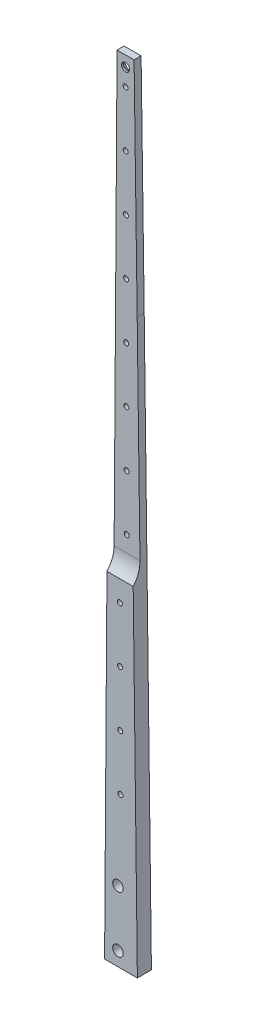
ISO-10303-21;
HEADER;
FILE_DESCRIPTION(('STEP AP214'),'2;1');
FILE_NAME('part.step','',(''),(''),'','','');
FILE_SCHEMA(('AUTOMOTIVE_DESIGN { 1 0 10303 214 1 1 1 1 }'));
ENDSEC;
DATA;
#1=APPLICATION_CONTEXT('core data for automotive mechanical design processes');
#2=APPLICATION_PROTOCOL_DEFINITION('international standard','automotive_design',2000,#1);
#3=PRODUCT_CONTEXT('',#1,'mechanical');
#4=PRODUCT('Part','Part','',(#3));
#5=PRODUCT_RELATED_PRODUCT_CATEGORY('part','',(#4));
#6=PRODUCT_DEFINITION_FORMATION('','',#4);
#7=PRODUCT_DEFINITION_CONTEXT('part definition',#1,'design');
#8=PRODUCT_DEFINITION('design','',#6,#7);
#9=PRODUCT_DEFINITION_SHAPE('','',#8);
#10=(LENGTH_UNIT() NAMED_UNIT(*) SI_UNIT(.MILLI.,.METRE.));
#11=(NAMED_UNIT(*) PLANE_ANGLE_UNIT() SI_UNIT($,.RADIAN.));
#12=(NAMED_UNIT(*) SI_UNIT($,.STERADIAN.) SOLID_ANGLE_UNIT());
#13=UNCERTAINTY_MEASURE_WITH_UNIT(LENGTH_MEASURE(1.E-05),#10,'distance_accuracy_value','');
#14=(GEOMETRIC_REPRESENTATION_CONTEXT(3) GLOBAL_UNCERTAINTY_ASSIGNED_CONTEXT((#13)) GLOBAL_UNIT_ASSIGNED_CONTEXT((#10,
#11,#12)) REPRESENTATION_CONTEXT('',''));
#15=CARTESIAN_POINT('',(0.,0.,0.));
#16=DIRECTION('',(0.,0.,1.));
#17=DIRECTION('',(1.,0.,0.));
#18=AXIS2_PLACEMENT_3D('',#15,#16,#17);
#19=CARTESIAN_POINT('',(9.32217062218469,164.894478893375,-6.35));
#20=DIRECTION('',(0.,0.,1.));
#21=DIRECTION('',(-1.,0.,0.));
#22=AXIS2_PLACEMENT_3D('',#19,#20,#21);
#23=PLANE('',#22);
#24=CARTESIAN_POINT('',(2.98775026478225,162.497082585507,-6.35));
#25=DIRECTION('',(0.,0.,1.));
#26=DIRECTION('',(1.,0.,0.));
#27=AXIS2_PLACEMENT_3D('',#24,#25,#26);
#28=CIRCLE('',#27,1.13029999999999);
#29=CARTESIAN_POINT('',(4.11805026478223,162.497082585507,-6.35));
#30=VERTEX_POINT('',#29);
#31=EDGE_CURVE('E251',#30,#30,#28,.T.);
#32=ORIENTED_EDGE('',*,*,#31,.T.);
#33=EDGE_LOOP('',(#32));
#34=FACE_BOUND('',#33,.T.);
#35=CARTESIAN_POINT('',(2.83264579083282,212.49684201095,-6.35));
#36=DIRECTION('',(0.,0.,1.));
#37=DIRECTION('',(1.,0.,0.));
#38=AXIS2_PLACEMENT_3D('',#35,#36,#37);
#39=CIRCLE('',#38,1.13029999999999);
#40=CARTESIAN_POINT('',(3.96294579083281,212.49684201095,-6.35));
#41=VERTEX_POINT('',#40);
#42=EDGE_CURVE('E274',#41,#41,#39,.T.);
#43=ORIENTED_EDGE('',*,*,#42,.T.);
#44=EDGE_LOOP('',(#43));
#45=FACE_BOUND('',#44,.T.);
#46=CARTESIAN_POINT('',(2.75509355385811,237.496721723671,-6.35));
#47=DIRECTION('',(0.,0.,1.));
#48=DIRECTION('',(1.,0.,0.));
#49=AXIS2_PLACEMENT_3D('',#46,#47,#48);
#50=CIRCLE('',#49,1.13029999999999);
#51=CARTESIAN_POINT('',(3.8853935538581,237.496721723671,-6.35));
#52=VERTEX_POINT('',#51);
#53=EDGE_CURVE('E280',#52,#52,#50,.T.);
#54=ORIENTED_EDGE('',*,*,#53,.T.);
#55=EDGE_LOOP('',(#54));
#56=FACE_BOUND('',#55,.T.);
#57=CARTESIAN_POINT('',(2.36733236898454,362.496120287279,-6.35));
#58=DIRECTION('',(0.,0.,1.));
#59=DIRECTION('',(1.,0.,0.));
#60=AXIS2_PLACEMENT_3D('',#57,#58,#59);
#61=CIRCLE('',#60,1.13029999999999);
#62=CARTESIAN_POINT('',(3.49763236898453,362.496120287279,-6.35));
#63=VERTEX_POINT('',#62);
#64=EDGE_CURVE('E236',#63,#63,#61,.T.);
#65=ORIENTED_EDGE('',*,*,#64,.T.);
#66=EDGE_LOOP('',(#65));
#67=FACE_BOUND('',#66,.T.);
#68=CARTESIAN_POINT('',(2.28978013200983,387.496,-6.35));
#69=DIRECTION('',(0.,0.,1.));
#70=DIRECTION('',(1.,0.,0.));
#71=AXIS2_PLACEMENT_3D('',#68,#69,#70);
#72=CIRCLE('',#71,1.13029999999999);
#73=CARTESIAN_POINT('',(3.42008013200982,387.496,-6.35));
#74=VERTEX_POINT('',#73);
#75=EDGE_CURVE('E232',#74,#74,#72,.T.);
#76=ORIENTED_EDGE('',*,*,#75,.T.);
#77=EDGE_LOOP('',(#76));
#78=FACE_BOUND('',#77,.T.);
#79=CARTESIAN_POINT('',(2.03199999999999,76.2,-6.35));
#80=DIRECTION('',(0.,0.,1.));
#81=DIRECTION('',(1.,0.,0.));
#82=AXIS2_PLACEMENT_3D('',#79,#80,#81);
#83=CIRCLE('',#82,2.38125);
#84=CARTESIAN_POINT('',(4.41324999999999,76.2,-6.35));
#85=VERTEX_POINT('',#84);
#86=EDGE_CURVE('E342',#85,#85,#83,.T.);
#87=ORIENTED_EDGE('',*,*,#86,.T.);
#88=EDGE_LOOP('',(#87));
#89=FACE_BOUND('',#88,.T.);
#90=CARTESIAN_POINT('',(2.03199999999999,50.8,-6.35));
#91=DIRECTION('',(0.,0.,1.));
#92=DIRECTION('',(1.,0.,0.));
#93=AXIS2_PLACEMENT_3D('',#90,#91,#92);
#94=CIRCLE('',#93,2.38125);
#95=CARTESIAN_POINT('',(4.41324999999999,50.8,-6.35));
#96=VERTEX_POINT('',#95);
#97=EDGE_CURVE('E336',#96,#96,#94,.T.);
#98=ORIENTED_EDGE('',*,*,#97,.T.);
#99=EDGE_LOOP('',(#98));
#100=FACE_BOUND('',#99,.T.);
#101=CARTESIAN_POINT('',(2.28978013200885,395.2335,-6.35));
#102=DIRECTION('',(0.,0.,1.));
#103=DIRECTION('',(1.,0.,0.));
#104=AXIS2_PLACEMENT_3D('',#101,#102,#103);
#105=CIRCLE('',#104,3.8989);
#106=CARTESIAN_POINT('',(-1.59728519476518,394.929947112695,-6.35));
#107=VERTEX_POINT('',#106);
#108=CARTESIAN_POINT('',(-1.59303981376289,395.587237867228,-6.35));
#109=VERTEX_POINT('',#108);
#110=EDGE_CURVE('E327',#107,#109,#105,.T.);
#111=ORIENTED_EDGE('',*,*,#110,.T.);
#112=CARTESIAN_POINT('',(-1.56462820167378,399.996,-6.35));
#113=CARTESIAN_POINT('',(-1.6371747875035,388.716209790455,-6.35));
#114=CARTESIAN_POINT('',(-1.71083889844835,377.436426733535,-6.35));
#115=CARTESIAN_POINT('',(-1.93103005471591,344.124623437937,-6.35));
#116=CARTESIAN_POINT('',(-2.08019527510727,322.071076557673,-6.35));
#117=CARTESIAN_POINT('',(-2.23129548472252,300.017543046815,-6.35));
#118=CARTESIAN_POINT('',(-2.23144308921492,299.996,-6.35));
#119=B_SPLINE_CURVE_WITH_KNOTS('',3,(#112,#113,#114,#115,#116,#117,#118),.UNSPECIFIED.,.F.,.F.,
(4,2,1,4),(0.,0.338393179002608,0.999353707800301,1.),.UNSPECIFIED.);
#120=CARTESIAN_POINT('',(-1.56462820167378,399.996,-6.35));
#121=VERTEX_POINT('',#120);
#122=EDGE_CURVE('E190',#121,#109,#119,.T.);
#123=ORIENTED_EDGE('',*,*,#122,.F.);
#124=DIRECTION('',(-1.,0.,0.));
#125=VECTOR('',#124,1.);
#126=CARTESIAN_POINT('',(6.14418846569149,399.996,-6.35));
#127=LINE('',#126,#125);
#128=CARTESIAN_POINT('',(6.14418846569149,399.996,-6.35));
#129=VERTEX_POINT('',#128);
#130=EDGE_CURVE('E197',#129,#121,#127,.T.);
#131=ORIENTED_EDGE('',*,*,#130,.F.);
#132=CARTESIAN_POINT('',(7.54616151705475,299.996,-6.35));
#133=CARTESIAN_POINT('',(7.09200287333961,333.329517912994,-6.35));
#134=CARTESIAN_POINT('',(6.6238073662164,366.662839032945,-6.35));
#135=CARTESIAN_POINT('',(6.14418846569149,399.996,-6.35));
#136=B_SPLINE_CURVE_WITH_KNOTS('',3,(#132,#133,#134,#135),.UNSPECIFIED.,.F.,.F.,(4,4),(0.,1.),.UNSPECIFIED.);
#137=CARTESIAN_POINT('',(7.54616151705475,299.996,-6.35));
#138=VERTEX_POINT('',#137);
#139=EDGE_CURVE('E203',#138,#129,#136,.T.);
#140=ORIENTED_EDGE('',*,*,#139,.F.);
#141=CARTESIAN_POINT('',(10.978749619499,29.7914342855853,-6.35));
#142=CARTESIAN_POINT('',(9.91085869355929,119.860572239238,-6.35));
#143=CARTESIAN_POINT('',(8.77329258674864,209.928893381234,-6.35));
#144=CARTESIAN_POINT('',(7.54616151705476,299.996,-6.35));
#145=B_SPLINE_CURVE_WITH_KNOTS('',3,(#141,#142,#143,#144),.UNSPECIFIED.,.F.,.F.,(4,4),(0.,1.),.UNSPECIFIED.);
#146=CARTESIAN_POINT('',(10.804334160404,44.45,-6.35));
#147=VERTEX_POINT('',#146);
#148=EDGE_CURVE('E131',#147,#138,#145,.T.);
#149=ORIENTED_EDGE('',*,*,#148,.F.);
#150=DIRECTION('',(-1.,0.,0.));
#151=VECTOR('',#150,1.);
#152=CARTESIAN_POINT('',(12.7,44.45,-6.35));
#153=LINE('',#152,#151);
#154=CARTESIAN_POINT('',(-4.0188922710135,44.45,-6.35));
#155=VERTEX_POINT('',#154);
#156=EDGE_CURVE('E348',#147,#155,#153,.T.);
#157=ORIENTED_EDGE('',*,*,#156,.T.);
#158=CARTESIAN_POINT('',(-2.23144308921492,299.996,-6.35));
#159=CARTESIAN_POINT('',(-2.23491000056348,299.490015836162,-6.35));
#160=CARTESIAN_POINT('',(-2.39299843190897,276.424514525694,-6.35));
#161=CARTESIAN_POINT('',(-2.55314908860154,253.359027395926,-6.35));
#162=CARTESIAN_POINT('',(-2.86833907382584,208.240034357139,-6.35));
#163=CARTESIAN_POINT('',(-3.0269190975399,185.680544745873,-6.35));
#164=CARTESIAN_POINT('',(-3.34635833842684,140.300046379748,-6.35));
#165=CARTESIAN_POINT('',(-3.65559703839005,96.4206918557666,-6.35));
#166=CARTESIAN_POINT('',(-3.9627245604797,52.541322480231,-6.35));
#167=CARTESIAN_POINT('',(-4.10919890948207,31.4829633980397,-6.35));
#168=B_SPLINE_CURVE_WITH_KNOTS('',3,(#158,#159,#160,#161,#162,#163,#164,#165,#166,#167),
.UNSPECIFIED.,.F.,.F.,(4,1,2,2,1,4),(0.,0.00565317431811734,0.257702337274979,0.509751499418767,
0.764722557038449,1.),.UNSPECIFIED.);
#169=CARTESIAN_POINT('',(-2.23144308921492,299.996,-6.35));
#170=VERTEX_POINT('',#169);
#171=EDGE_CURVE('E138',#170,#155,#168,.T.);
#172=ORIENTED_EDGE('',*,*,#171,.F.);
#173=EDGE_CURVE('E196',#107,#170,#119,.T.);
#174=ORIENTED_EDGE('',*,*,#173,.F.);
#175=EDGE_LOOP('',(#111,#123,#131,#140,#149,#157,#172,#174));
#176=FACE_BOUND('',#175,.T.);
#177=CARTESIAN_POINT('',(2.44488460595926,337.496240574557,-6.35));
#178=DIRECTION('',(0.,0.,1.));
#179=DIRECTION('',(1.,0.,0.));
#180=AXIS2_PLACEMENT_3D('',#177,#178,#179);
#181=CIRCLE('',#180,1.13029999999999);
#182=CARTESIAN_POINT('',(3.57518460595924,337.496240574557,-6.35));
#183=VERTEX_POINT('',#182);
#184=EDGE_CURVE('E237',#183,#183,#181,.T.);
#185=ORIENTED_EDGE('',*,*,#184,.T.);
#186=EDGE_LOOP('',(#185));
#187=FACE_BOUND('',#186,.T.);
#188=CARTESIAN_POINT('',(2.52243684293397,312.496360861836,-6.35));
#189=DIRECTION('',(0.,0.,1.));
#190=DIRECTION('',(1.,0.,0.));
#191=AXIS2_PLACEMENT_3D('',#188,#189,#190);
#192=CIRCLE('',#191,1.13029999999999);
#193=CARTESIAN_POINT('',(3.65273684293396,312.496360861836,-6.35));
#194=VERTEX_POINT('',#193);
#195=EDGE_CURVE('E241',#194,#194,#192,.T.);
#196=ORIENTED_EDGE('',*,*,#195,.T.);
#197=EDGE_LOOP('',(#196));
#198=FACE_BOUND('',#197,.T.);
#199=CARTESIAN_POINT('',(2.59998907990868,287.496481149114,-6.35));
#200=DIRECTION('',(0.,0.,1.));
#201=DIRECTION('',(1.,0.,0.));
#202=AXIS2_PLACEMENT_3D('',#199,#200,#201);
#203=CIRCLE('',#202,1.13029999999999);
#204=CARTESIAN_POINT('',(3.73028907990867,287.496481149114,-6.35));
#205=VERTEX_POINT('',#204);
#206=EDGE_CURVE('E245',#205,#205,#203,.T.);
#207=ORIENTED_EDGE('',*,*,#206,.T.);
#208=EDGE_LOOP('',(#207));
#209=FACE_BOUND('',#208,.T.);
#210=CARTESIAN_POINT('',(2.6775413168834,262.496601436393,-6.35));
#211=DIRECTION('',(0.,0.,1.));
#212=DIRECTION('',(1.,0.,0.));
#213=AXIS2_PLACEMENT_3D('',#210,#211,#212);
#214=CIRCLE('',#213,1.13029999999999);
#215=CARTESIAN_POINT('',(3.80784131688338,262.496601436393,-6.35));
#216=VERTEX_POINT('',#215);
#217=EDGE_CURVE('E248',#216,#216,#214,.T.);
#218=ORIENTED_EDGE('',*,*,#217,.T.);
#219=EDGE_LOOP('',(#218));
#220=FACE_BOUND('',#219,.T.);
#221=CARTESIAN_POINT('',(2.91019802780753,187.496962298229,-6.35));
#222=DIRECTION('',(0.,0.,1.));
#223=DIRECTION('',(1.,0.,0.));
#224=AXIS2_PLACEMENT_3D('',#221,#222,#223);
#225=CIRCLE('',#224,1.13029999999999);
#226=CARTESIAN_POINT('',(4.04049802780752,187.496962298229,-6.35));
#227=VERTEX_POINT('',#226);
#228=EDGE_CURVE('E268',#227,#227,#225,.T.);
#229=ORIENTED_EDGE('',*,*,#228,.T.);
#230=EDGE_LOOP('',(#229));
#231=FACE_BOUND('',#230,.T.);
#232=CARTESIAN_POINT('',(3.06530250175696,137.497202872786,-6.35));
#233=DIRECTION('',(0.,0.,1.));
#234=DIRECTION('',(1.,0.,0.));
#235=AXIS2_PLACEMENT_3D('',#232,#233,#234);
#236=CIRCLE('',#235,1.13029999999999);
#237=CARTESIAN_POINT('',(4.19560250175695,137.497202872786,-6.35));
#238=VERTEX_POINT('',#237);
#239=EDGE_CURVE('E252',#238,#238,#236,.T.);
#240=ORIENTED_EDGE('',*,*,#239,.T.);
#241=EDGE_LOOP('',(#240));
#242=FACE_BOUND('',#241,.T.);
#243=CARTESIAN_POINT('',(3.14285473873167,112.497323160064,-6.35));
#244=DIRECTION('',(0.,0.,1.));
#245=DIRECTION('',(1.,0.,0.));
#246=AXIS2_PLACEMENT_3D('',#243,#244,#245);
#247=CIRCLE('',#246,1.13029999999999);
#248=CARTESIAN_POINT('',(4.27315473873166,112.497323160064,-6.35));
#249=VERTEX_POINT('',#248);
#250=EDGE_CURVE('E263',#249,#249,#247,.T.);
#251=ORIENTED_EDGE('',*,*,#250,.T.);
#252=EDGE_LOOP('',(#251));
#253=FACE_BOUND('',#252,.T.);
#254=ADVANCED_FACE('F39',(#34,#45,#56,#67,#78,#89,#100,#176,#187,#198,#209,#220,#231,#242,#253),
#23,.F.);
#255=DIRECTION('',(0.,0.,1.));
#256=VECTOR('',#255,1.);
#257=SURFACE_OF_LINEAR_EXTRUSION('',#136,#256);
#258=CARTESIAN_POINT('',(7.54616151705475,299.996,-3.175));
#259=CARTESIAN_POINT('',(7.09200287333961,333.329517912994,-3.175));
#260=CARTESIAN_POINT('',(6.6238073662164,366.662839032945,-3.175));
#261=CARTESIAN_POINT('',(6.14418846569149,399.996,-3.175));
#262=B_SPLINE_CURVE_WITH_KNOTS('',3,(#258,#259,#260,#261),.UNSPECIFIED.,.F.,.F.,(4,4),(0.,1.),.UNSPECIFIED.);
#263=CARTESIAN_POINT('',(6.14418846569149,399.996,-3.175));
#264=VERTEX_POINT('',#263);
#265=CARTESIAN_POINT('',(7.54616151705475,299.996,-3.175));
#266=VERTEX_POINT('',#265);
#267=EDGE_CURVE('E313',#264,#266,#262,.F.);
#268=ORIENTED_EDGE('',*,*,#267,.T.);
#269=DIRECTION('',(0.,0.,1.));
#270=VECTOR('',#269,1.);
#271=CARTESIAN_POINT('',(7.54616151705475,299.996,-6.35));
#272=LINE('',#271,#270);
#273=EDGE_CURVE('E161',#138,#266,#272,.T.);
#274=ORIENTED_EDGE('',*,*,#273,.F.);
#275=ORIENTED_EDGE('',*,*,#139,.T.);
#276=DIRECTION('',(0.,0.,1.));
#277=VECTOR('',#276,1.);
#278=CARTESIAN_POINT('',(6.14418846569149,399.996,-6.35));
#279=LINE('',#278,#277);
#280=EDGE_CURVE('E158',#129,#264,#279,.T.);
#281=ORIENTED_EDGE('',*,*,#280,.T.);
#282=EDGE_LOOP('',(#268,#274,#275,#281));
#283=FACE_BOUND('',#282,.T.);
#284=ADVANCED_FACE('F215',(#283),#257,.T.);
#285=CARTESIAN_POINT('',(6.14418846569149,399.996,-6.35));
#286=DIRECTION('',(0.,-1.,0.));
#287=DIRECTION('',(1.,0.,0.));
#288=AXIS2_PLACEMENT_3D('',#285,#286,#287);
#289=PLANE('',#288);
#290=DIRECTION('',(1.,0.,0.));
#291=VECTOR('',#290,1.);
#292=CARTESIAN_POINT('',(-13.374739093365,399.996,-3.175));
#293=LINE('',#292,#291);
#294=CARTESIAN_POINT('',(-1.56462820167378,399.996,-3.175));
#295=VERTEX_POINT('',#294);
#296=EDGE_CURVE('E115',#295,#264,#293,.T.);
#297=ORIENTED_EDGE('',*,*,#296,.T.);
#298=ORIENTED_EDGE('',*,*,#280,.F.);
#299=ORIENTED_EDGE('',*,*,#130,.T.);
#300=DIRECTION('',(0.,0.,1.));
#301=VECTOR('',#300,1.);
#302=CARTESIAN_POINT('',(-1.56462820167378,399.996,-6.35));
#303=LINE('',#302,#301);
#304=EDGE_CURVE('E155',#121,#295,#303,.T.);
#305=ORIENTED_EDGE('',*,*,#304,.T.);
#306=EDGE_LOOP('',(#297,#298,#299,#305));
#307=FACE_BOUND('',#306,.T.);
#308=ADVANCED_FACE('F184',(#307),#289,.F.);
#309=DIRECTION('',(0.,0.,1.));
#310=VECTOR('',#309,1.);
#311=SURFACE_OF_LINEAR_EXTRUSION('',#119,#310);
#312=CARTESIAN_POINT('',(-1.56462820167378,399.996,-3.175));
#313=CARTESIAN_POINT('',(-1.6371747875035,388.716209790455,-3.175));
#314=CARTESIAN_POINT('',(-1.71083889844835,377.436426733535,-3.175));
#315=CARTESIAN_POINT('',(-1.93103005471591,344.124623437937,-3.175));
#316=CARTESIAN_POINT('',(-2.08019527510727,322.071076557673,-3.175));
#317=CARTESIAN_POINT('',(-2.23129548472252,300.017543046815,-3.175));
#318=CARTESIAN_POINT('',(-2.23144308921492,299.996,-3.175));
#319=B_SPLINE_CURVE_WITH_KNOTS('',3,(#312,#313,#314,#315,#316,#317,#318),.UNSPECIFIED.,.F.,.F.,
(4,2,1,4),(0.,0.338393179002608,0.999353707800301,1.),.UNSPECIFIED.);
#320=CARTESIAN_POINT('',(-2.23144308921492,299.996,-3.175));
#321=VERTEX_POINT('',#320);
#322=EDGE_CURVE('E302',#321,#295,#319,.F.);
#323=ORIENTED_EDGE('',*,*,#322,.T.);
#324=ORIENTED_EDGE('',*,*,#304,.F.);
#325=ORIENTED_EDGE('',*,*,#122,.T.);
#326=CARTESIAN_POINT('',(-1.59728519476517,394.929947112695,-6.35));
#327=CARTESIAN_POINT('',(-1.59657742632141,395.03949557046,-6.3393578368422));
#328=CARTESIAN_POINT('',(-1.59586976034934,395.149044028887,-6.33403675526322));
#329=CARTESIAN_POINT('',(-1.59445463334857,395.368140947065,-6.33403675526292));
#330=CARTESIAN_POINT('',(-1.59374717231988,395.477689406816,-6.3393578368416));
#331=CARTESIAN_POINT('',(-1.59303981376289,395.587237867228,-6.3499999999991));
#332=B_SPLINE_CURVE_WITH_KNOTS('',3,(#326,#327,#328,#329,#330,#331),.UNSPECIFIED.,.F.,.F.,(4,2,
4),(0.,0.329039686050416,0.658079372100812),.UNSPECIFIED.);
#333=EDGE_CURVE('E164',#107,#109,#332,.T.);
#334=ORIENTED_EDGE('',*,*,#333,.F.);
#335=ORIENTED_EDGE('',*,*,#173,.T.);
#336=DIRECTION('',(0.,0.,1.));
#337=VECTOR('',#336,1.);
#338=CARTESIAN_POINT('',(-2.23144308921492,299.996,-6.35));
#339=LINE('',#338,#337);
#340=EDGE_CURVE('E149',#170,#321,#339,.T.);
#341=ORIENTED_EDGE('',*,*,#340,.T.);
#342=EDGE_LOOP('',(#323,#324,#325,#334,#335,#341));
#343=FACE_BOUND('',#342,.T.);
#344=ADVANCED_FACE('F178',(#343),#311,.T.);
#345=CARTESIAN_POINT('',(2.28978013200885,395.2335,-6.35));
#346=DIRECTION('',(0.,0.,-1.));
#347=DIRECTION('',(1.,0.,0.));
#348=AXIS2_PLACEMENT_3D('',#345,#346,#347);
#349=CYLINDRICAL_SURFACE('',#348,1.82879999999999);
#350=CARTESIAN_POINT('',(2.28978013200885,395.2335,-3.96862236021177));
#351=DIRECTION('',(0.,0.,1.));
#352=DIRECTION('',(1.,0.,0.));
#353=AXIS2_PLACEMENT_3D('',#350,#351,#352);
#354=CIRCLE('',#353,1.82879999999999);
#355=CARTESIAN_POINT('',(4.11858013200884,395.2335,-3.96862236021177));
#356=VERTEX_POINT('',#355);
#357=EDGE_CURVE('E333',#356,#356,#354,.T.);
#358=ORIENTED_EDGE('',*,*,#357,.F.);
#359=EDGE_LOOP('',(#358));
#360=FACE_BOUND('',#359,.T.);
#361=CARTESIAN_POINT('',(2.28978013200885,395.2335,-3.175));
#362=DIRECTION('',(0.,0.,-1.));
#363=DIRECTION('',(-1.,0.,0.));
#364=AXIS2_PLACEMENT_3D('',#361,#362,#363);
#365=CIRCLE('',#364,1.82879999999999);
#366=CARTESIAN_POINT('',(0.460980132008861,395.2335,-3.175));
#367=VERTEX_POINT('',#366);
#368=EDGE_CURVE('E172',#367,#367,#365,.F.);
#369=ORIENTED_EDGE('',*,*,#368,.T.);
#370=EDGE_LOOP('',(#369));
#371=FACE_BOUND('',#370,.T.);
#372=ADVANCED_FACE('F183',(#360,#371),#349,.F.);
#373=DIRECTION('',(0.,0.,1.));
#374=VECTOR('',#373,1.);
#375=SURFACE_OF_LINEAR_EXTRUSION('',#145,#374);
#376=CARTESIAN_POINT('',(10.978749619499,29.7914342855853,0.));
#377=CARTESIAN_POINT('',(9.91085869355929,119.860572239238,0.));
#378=CARTESIAN_POINT('',(8.77329258674864,209.928893381234,0.));
#379=CARTESIAN_POINT('',(7.54616151705476,299.996,0.));
#380=B_SPLINE_CURVE_WITH_KNOTS('',3,(#376,#377,#378,#379),.UNSPECIFIED.,.F.,.F.,(4,4),(0.,1.),.UNSPECIFIED.);
#381=CARTESIAN_POINT('',(10.804334160404,44.45,0.));
#382=VERTEX_POINT('',#381);
#383=CARTESIAN_POINT('',(8.91412882013365,196.796,0.));
#384=VERTEX_POINT('',#383);
#385=EDGE_CURVE('E121',#382,#384,#380,.T.);
#386=ORIENTED_EDGE('',*,*,#385,.F.);
#387=DIRECTION('',(0.,0.,1.));
#388=VECTOR('',#387,1.);
#389=CARTESIAN_POINT('',(10.804334160404,44.45,-6.35));
#390=LINE('',#389,#388);
#391=EDGE_CURVE('E129',#382,#147,#390,.F.);
#392=ORIENTED_EDGE('',*,*,#391,.T.);
#393=ORIENTED_EDGE('',*,*,#148,.T.);
#394=ORIENTED_EDGE('',*,*,#273,.T.);
#395=CARTESIAN_POINT('',(10.978749619499,29.7914342855853,-3.175));
#396=CARTESIAN_POINT('',(9.91085869355929,119.860572239238,-3.175));
#397=CARTESIAN_POINT('',(8.77329258674864,209.928893381234,-3.175));
#398=CARTESIAN_POINT('',(7.54616151705476,299.996,-3.175));
#399=B_SPLINE_CURVE_WITH_KNOTS('',3,(#395,#396,#397,#398),.UNSPECIFIED.,.F.,.F.,(4,4),(0.,1.),.UNSPECIFIED.);
#400=CARTESIAN_POINT('',(8.80555145099561,205.19626041263,-3.175));
#401=VERTEX_POINT('',#400);
#402=EDGE_CURVE('E123',#266,#401,#399,.F.);
#403=ORIENTED_EDGE('',*,*,#402,.T.);
#404=CARTESIAN_POINT('',(8.91412882013365,196.796,0.));
#405=CARTESIAN_POINT('',(8.911828108261,196.974389819341,-0.157335072633163));
#406=CARTESIAN_POINT('',(8.90946995587916,197.157208325913,-0.309646369273341));
#407=CARTESIAN_POINT('',(8.90464639388709,197.531104583722,-0.603766508876963));
#408=CARTESIAN_POINT('',(8.90218098467464,197.722182304328,-0.745575390785927));
#409=CARTESIAN_POINT('',(8.89715049973853,198.112001424151,-1.01823783449251));
#410=CARTESIAN_POINT('',(8.89458542338508,198.310742871793,-1.14909132704896));
#411=CARTESIAN_POINT('',(8.88935941226531,198.715587456393,-1.39963437007923));
#412=CARTESIAN_POINT('',(8.88669832837307,198.921702041222,-1.51930541647878));
#413=CARTESIAN_POINT('',(8.8812926148244,199.340332392736,-1.74686136706235));
#414=CARTESIAN_POINT('',(8.87854798783908,199.552847954761,-1.85474664756565));
#415=CARTESIAN_POINT('',(8.87298408626675,199.983585208736,-2.05838381582487));
#416=CARTESIAN_POINT('',(8.87016481544353,200.201806612972,-2.15413631395131));
#417=CARTESIAN_POINT('',(8.86303123314621,200.753873861041,-2.37806534004997));
#418=CARTESIAN_POINT('',(8.85867511881369,201.09090686319,-2.49847274724908));
#419=CARTESIAN_POINT('',(8.84984454391639,201.773943309004,-2.71042612609173));
#420=CARTESIAN_POINT('',(8.84537006921629,202.119947824002,-2.80196863349355));
#421=CARTESIAN_POINT('',(8.83634660548468,202.817525384162,-2.95533787687691));
#422=CARTESIAN_POINT('',(8.83179784078929,203.169081585676,-3.01724136010271));
#423=CARTESIAN_POINT('',(8.82264852492716,203.875998324093,-3.11121449868237));
#424=CARTESIAN_POINT('',(8.81804800815526,204.231356327394,-3.14330290613172));
#425=CARTESIAN_POINT('',(8.8121246194314,204.688768537435,-3.16526342147526));
#426=CARTESIAN_POINT('',(8.81081000498075,204.790276763341,-3.16891592709835));
#427=CARTESIAN_POINT('',(8.80818082216675,204.993273452835,-3.17378292151737));
#428=CARTESIAN_POINT('',(8.80686625454704,205.094761871478,-3.1749992850327));
#429=CARTESIAN_POINT('',(8.80555145099561,205.19626041263,-3.175));
#430=B_SPLINE_CURVE_WITH_KNOTS('',3,(#404,#405,#406,#407,#408,#409,#410,#411,#412,#413,#414,
#415,#416,#417,#418,#419,#420,#421,#422,#423,#424,#425,#426,#427,#428,#429),.UNSPECIFIED.,.F.,
.F.,(4,2,2,2,2,2,2,2,2,2,2,2,4),(0.,0.713517269334272,1.42703189263964,2.14055102521979,
2.85523068123177,3.56988751086187,4.2845083735726,5.35692452345507,6.42946933118895,
7.49922166845128,8.56830073210423,8.87302895639274,9.17752258855459),.UNSPECIFIED.);
#431=EDGE_CURVE('E11',#384,#401,#430,.T.);
#432=ORIENTED_EDGE('',*,*,#431,.F.);
#433=EDGE_LOOP('',(#386,#392,#393,#394,#403,#432));
#434=FACE_BOUND('',#433,.T.);
#435=ADVANCED_FACE('F120',(#434),#375,.T.);
#436=DIRECTION('',(0.,0.,1.));
#437=VECTOR('',#436,1.);
#438=SURFACE_OF_LINEAR_EXTRUSION('',#168,#437);
#439=CARTESIAN_POINT('',(-2.23144308921492,299.996,-3.175));
#440=CARTESIAN_POINT('',(-2.23491000056348,299.490015836162,-3.175));
#441=CARTESIAN_POINT('',(-2.39299843190897,276.424514525694,-3.175));
#442=CARTESIAN_POINT('',(-2.55314908860154,253.359027395926,-3.175));
#443=CARTESIAN_POINT('',(-2.86833907382584,208.240034357139,-3.175));
#444=CARTESIAN_POINT('',(-3.0269190975399,185.680544745873,-3.175));
#445=CARTESIAN_POINT('',(-3.34635833842684,140.300046379748,-3.175));
#446=CARTESIAN_POINT('',(-3.65559703839005,96.4206918557666,-3.175));
#447=CARTESIAN_POINT('',(-3.9627245604797,52.541322480231,-3.175));
#448=CARTESIAN_POINT('',(-4.10919890948207,31.4829633980397,-3.175));
#449=B_SPLINE_CURVE_WITH_KNOTS('',3,(#439,#440,#441,#442,#443,#444,#445,#446,#447,#448),
.UNSPECIFIED.,.F.,.F.,(4,1,2,2,1,4),(0.,0.00565317431811734,0.257702337274979,0.509751499418767,
0.764722557038449,1.),.UNSPECIFIED.);
#450=CARTESIAN_POINT('',(-2.88998359130755,205.19626041263,-3.175));
#451=VERTEX_POINT('',#450);
#452=EDGE_CURVE('E306',#451,#321,#449,.F.);
#453=ORIENTED_EDGE('',*,*,#452,.T.);
#454=ORIENTED_EDGE('',*,*,#340,.F.);
#455=ORIENTED_EDGE('',*,*,#171,.T.);
#456=DIRECTION('',(0.,0.,1.));
#457=VECTOR('',#456,1.);
#458=CARTESIAN_POINT('',(-4.0188922710135,44.4500000000001,-6.35));
#459=LINE('',#458,#457);
#460=CARTESIAN_POINT('',(-4.0188922710135,44.4500000000001,0.));
#461=VERTEX_POINT('',#460);
#462=EDGE_CURVE('E133',#155,#461,#459,.T.);
#463=ORIENTED_EDGE('',*,*,#462,.T.);
#464=CARTESIAN_POINT('',(-2.23144308921492,299.996,0.));
#465=CARTESIAN_POINT('',(-2.23491000056348,299.490015836162,0.));
#466=CARTESIAN_POINT('',(-2.39299843190897,276.424514525694,0.));
#467=CARTESIAN_POINT('',(-2.55314908860154,253.359027395926,0.));
#468=CARTESIAN_POINT('',(-2.86833907382584,208.240034357139,0.));
#469=CARTESIAN_POINT('',(-3.0269190975399,185.680544745873,0.));
#470=CARTESIAN_POINT('',(-3.34635833842684,140.300046379748,0.));
#471=CARTESIAN_POINT('',(-3.65559703839005,96.4206918557666,0.));
#472=CARTESIAN_POINT('',(-3.9627245604797,52.541322480231,0.));
#473=CARTESIAN_POINT('',(-4.10919890948207,31.4829633980397,0.));
#474=B_SPLINE_CURVE_WITH_KNOTS('',3,(#464,#465,#466,#467,#468,#469,#470,#471,#472,#473),
.UNSPECIFIED.,.F.,.F.,(4,1,2,2,1,4),(0.,0.00565317431811734,0.257702337274979,0.509751499418767,
0.764722557038449,1.),.UNSPECIFIED.);
#475=CARTESIAN_POINT('',(-2.94893309170267,196.796,0.));
#476=VERTEX_POINT('',#475);
#477=EDGE_CURVE('E128',#476,#461,#474,.T.);
#478=ORIENTED_EDGE('',*,*,#477,.F.);
#479=CARTESIAN_POINT('',(-2.88998359130755,205.19626041263,-3.175));
#480=CARTESIAN_POINT('',(-2.89165183874844,204.958412578871,-3.17500752847791));
#481=CARTESIAN_POINT('',(-2.89332015830395,204.720565578128,-3.16831859484388));
#482=CARTESIAN_POINT('',(-2.89665168191138,204.245622534799,-3.14160204766512));
#483=CARTESIAN_POINT('',(-2.89831488598,204.008526489763,-3.12157447769535));
#484=CARTESIAN_POINT('',(-2.90163094053523,203.53583156292,-3.06823472961054));
#485=CARTESIAN_POINT('',(-2.90328379095505,203.300232690772,-3.03492246587616));
#486=CARTESIAN_POINT('',(-2.90657658002036,202.830896009602,-2.9550563141124));
#487=CARTESIAN_POINT('',(-2.90821649324717,202.59716185735,-2.90848094435861));
#488=CARTESIAN_POINT('',(-2.91147545608705,202.132687140085,-2.80225708524711));
#489=CARTESIAN_POINT('',(-2.91309450636706,201.901946479374,-2.7426090148972));
#490=CARTESIAN_POINT('',(-2.91630646610926,201.444209730419,-2.61043886245811));
#491=CARTESIAN_POINT('',(-2.91789937688371,201.217213454194,-2.53791742881419));
#492=CARTESIAN_POINT('',(-2.92184438942098,200.655055825937,-2.34071612801329));
#493=CARTESIAN_POINT('',(-2.92417728985362,200.322642124007,-2.20810131874011));
#494=CARTESIAN_POINT('',(-2.92875661094883,199.670174468599,-1.91529187002999));
#495=CARTESIAN_POINT('',(-2.93100302120644,199.35012200219,-1.75509392488738));
#496=CARTESIAN_POINT('',(-2.93538744575451,198.725494021564,-1.4087273788733));
#497=CARTESIAN_POINT('',(-2.93752572711715,198.420880369643,-1.22262750338411));
#498=CARTESIAN_POINT('',(-2.94168401590971,197.8285314774,-0.825535178370847));
#499=CARTESIAN_POINT('',(-2.94370409693932,197.540785733745,-0.614558471071702));
#500=CARTESIAN_POINT('',(-2.94621477888913,197.183173808138,-0.328465522106508));
#501=CARTESIAN_POINT('',(-2.9467664063294,197.104603175068,-0.264045584764277));
#502=CARTESIAN_POINT('',(-2.9478582435841,196.949090190476,-0.133389137092061));
#503=CARTESIAN_POINT('',(-2.94839846186122,196.872146632023,-0.0671540633876382));
#504=CARTESIAN_POINT('',(-2.94893309170267,196.796,0.));
#505=B_SPLINE_CURVE_WITH_KNOTS('',3,(#479,#480,#481,#482,#483,#484,#485,#486,#487,#488,#489,
#490,#491,#492,#493,#494,#495,#496,#497,#498,#499,#500,#501,#502,#503,#504),.UNSPECIFIED.,.F.,
.F.,(4,2,2,2,2,2,2,2,2,2,2,2,4),(0.,0.713465778958233,1.42692922716151,2.14039727368372,
2.85502753342702,3.56963489110384,4.28420626344326,5.35655048263683,6.42902330667366,
7.49870295048052,8.56770929039243,8.87250523323418,9.17706653573727),.UNSPECIFIED.);
#506=EDGE_CURVE('E49',#451,#476,#505,.T.);
#507=ORIENTED_EDGE('',*,*,#506,.F.);
#508=EDGE_LOOP('',(#453,#454,#455,#463,#478,#507));
#509=FACE_BOUND('',#508,.T.);
#510=ADVANCED_FACE('F186',(#509),#438,.T.);
#511=CARTESIAN_POINT('',(9.32217062218469,164.894478893375,0.));
#512=DIRECTION('',(0.,0.,1.));
#513=DIRECTION('',(-1.,0.,0.));
#514=AXIS2_PLACEMENT_3D('',#511,#512,#513);
#515=PLANE('',#514);
#516=CARTESIAN_POINT('',(3.14285473873167,112.497323160064,0.));
#517=DIRECTION('',(0.,0.,-1.));
#518=DIRECTION('',(-1.,0.,0.));
#519=AXIS2_PLACEMENT_3D('',#516,#517,#518);
#520=CIRCLE('',#519,1.13029999999999);
#521=CARTESIAN_POINT('',(2.01255473873168,112.497323160064,0.));
#522=VERTEX_POINT('',#521);
#523=EDGE_CURVE('E44',#522,#522,#520,.T.);
#524=ORIENTED_EDGE('',*,*,#523,.T.);
#525=EDGE_LOOP('',(#524));
#526=FACE_BOUND('',#525,.T.);
#527=CARTESIAN_POINT('',(3.06530250175696,137.497202872786,0.));
#528=DIRECTION('',(0.,0.,-1.));
#529=DIRECTION('',(-1.,0.,0.));
#530=AXIS2_PLACEMENT_3D('',#527,#528,#529);
#531=CIRCLE('',#530,1.13029999999999);
#532=CARTESIAN_POINT('',(1.93500250175697,137.497202872786,0.));
#533=VERTEX_POINT('',#532);
#534=EDGE_CURVE('E249',#533,#533,#531,.T.);
#535=ORIENTED_EDGE('',*,*,#534,.T.);
#536=EDGE_LOOP('',(#535));
#537=FACE_BOUND('',#536,.T.);
#538=CARTESIAN_POINT('',(2.98775026478225,162.497082585507,0.));
#539=DIRECTION('',(0.,0.,-1.));
#540=DIRECTION('',(-1.,0.,0.));
#541=AXIS2_PLACEMENT_3D('',#538,#539,#540);
#542=CIRCLE('',#541,1.13029999999999);
#543=CARTESIAN_POINT('',(1.85745026478225,162.497082585507,0.));
#544=VERTEX_POINT('',#543);
#545=EDGE_CURVE('E256',#544,#544,#542,.T.);
#546=ORIENTED_EDGE('',*,*,#545,.T.);
#547=EDGE_LOOP('',(#546));
#548=FACE_BOUND('',#547,.T.);
#549=CARTESIAN_POINT('',(2.91019802780753,187.496962298229,0.));
#550=DIRECTION('',(0.,0.,-1.));
#551=DIRECTION('',(-1.,0.,0.));
#552=AXIS2_PLACEMENT_3D('',#549,#550,#551);
#553=CIRCLE('',#552,1.13029999999999);
#554=CARTESIAN_POINT('',(1.77989802780754,187.496962298229,0.));
#555=VERTEX_POINT('',#554);
#556=EDGE_CURVE('E271',#555,#555,#553,.T.);
#557=ORIENTED_EDGE('',*,*,#556,.T.);
#558=EDGE_LOOP('',(#557));
#559=FACE_BOUND('',#558,.T.);
#560=DIRECTION('',(-1.,0.,0.));
#561=VECTOR('',#560,1.);
#562=CARTESIAN_POINT('',(-13.374739093365,196.796,0.));
#563=LINE('',#562,#561);
#564=EDGE_CURVE('E108',#384,#476,#563,.T.);
#565=ORIENTED_EDGE('',*,*,#564,.T.);
#566=ORIENTED_EDGE('',*,*,#477,.T.);
#567=DIRECTION('',(-1.,0.,0.));
#568=VECTOR('',#567,1.);
#569=CARTESIAN_POINT('',(9.32217062218472,44.45,0.));
#570=LINE('',#569,#568);
#571=EDGE_CURVE('E126',#382,#461,#570,.T.);
#572=ORIENTED_EDGE('',*,*,#571,.F.);
#573=ORIENTED_EDGE('',*,*,#385,.T.);
#574=EDGE_LOOP('',(#565,#566,#572,#573));
#575=FACE_BOUND('',#574,.T.);
#576=CARTESIAN_POINT('',(2.03199999999999,50.8,0.));
#577=DIRECTION('',(0.,0.,-1.));
#578=DIRECTION('',(-1.,0.,0.));
#579=AXIS2_PLACEMENT_3D('',#576,#577,#578);
#580=CIRCLE('',#579,2.38125);
#581=CARTESIAN_POINT('',(-0.349250000000003,50.8,0.));
#582=VERTEX_POINT('',#581);
#583=EDGE_CURVE('E339',#582,#582,#580,.T.);
#584=ORIENTED_EDGE('',*,*,#583,.T.);
#585=EDGE_LOOP('',(#584));
#586=FACE_BOUND('',#585,.T.);
#587=CARTESIAN_POINT('',(2.03199999999999,76.2,0.));
#588=DIRECTION('',(0.,0.,-1.));
#589=DIRECTION('',(-1.,0.,0.));
#590=AXIS2_PLACEMENT_3D('',#587,#588,#589);
#591=CIRCLE('',#590,2.38125);
#592=CARTESIAN_POINT('',(-0.349250000000007,76.2,0.));
#593=VERTEX_POINT('',#592);
#594=EDGE_CURVE('E345',#593,#593,#591,.T.);
#595=ORIENTED_EDGE('',*,*,#594,.T.);
#596=EDGE_LOOP('',(#595));
#597=FACE_BOUND('',#596,.T.);
#598=ADVANCED_FACE('F124',(#526,#537,#548,#559,#575,#586,#597),#515,.T.);
#599=CARTESIAN_POINT('',(12.7,44.45,-6.35));
#600=DIRECTION('',(0.,-1.,0.));
#601=DIRECTION('',(1.,0.,0.));
#602=AXIS2_PLACEMENT_3D('',#599,#600,#601);
#603=PLANE('',#602);
#604=ORIENTED_EDGE('',*,*,#391,.F.);
#605=ORIENTED_EDGE('',*,*,#571,.T.);
#606=ORIENTED_EDGE('',*,*,#462,.F.);
#607=ORIENTED_EDGE('',*,*,#156,.F.);
#608=EDGE_LOOP('',(#604,#605,#606,#607));
#609=FACE_BOUND('',#608,.T.);
#610=ADVANCED_FACE('F357',(#609),#603,.T.);
#611=CARTESIAN_POINT('',(2.03199999999999,76.2,-6.35));
#612=DIRECTION('',(0.,0.,-1.));
#613=DIRECTION('',(1.,0.,0.));
#614=AXIS2_PLACEMENT_3D('',#611,#612,#613);
#615=CYLINDRICAL_SURFACE('',#614,2.38125);
#616=ORIENTED_EDGE('',*,*,#594,.F.);
#617=EDGE_LOOP('',(#616));
#618=FACE_BOUND('',#617,.T.);
#619=ORIENTED_EDGE('',*,*,#86,.F.);
#620=EDGE_LOOP('',(#619));
#621=FACE_BOUND('',#620,.T.);
#622=ADVANCED_FACE('F382',(#618,#621),#615,.F.);
#623=CARTESIAN_POINT('',(2.03199999999999,50.8,-6.35));
#624=DIRECTION('',(0.,0.,-1.));
#625=DIRECTION('',(1.,0.,0.));
#626=AXIS2_PLACEMENT_3D('',#623,#624,#625);
#627=CYLINDRICAL_SURFACE('',#626,2.38125);
#628=ORIENTED_EDGE('',*,*,#583,.F.);
#629=EDGE_LOOP('',(#628));
#630=FACE_BOUND('',#629,.T.);
#631=ORIENTED_EDGE('',*,*,#97,.F.);
#632=EDGE_LOOP('',(#631));
#633=FACE_BOUND('',#632,.T.);
#634=ADVANCED_FACE('F375',(#630,#633),#627,.F.);
#635=CARTESIAN_POINT('',(2.28978013200885,395.2335,-6.35));
#636=DIRECTION('',(0.,0.,-1.));
#637=DIRECTION('',(1.,0.,0.));
#638=AXIS2_PLACEMENT_3D('',#635,#636,#637);
#639=CONICAL_SURFACE('',#638,3.8989,0.715584993317675);
#640=ORIENTED_EDGE('',*,*,#357,.T.);
#641=EDGE_LOOP('',(#640));
#642=FACE_BOUND('',#641,.T.);
#643=ORIENTED_EDGE('',*,*,#110,.F.);
#644=ORIENTED_EDGE('',*,*,#333,.T.);
#645=EDGE_LOOP('',(#643,#644));
#646=FACE_BOUND('',#645,.T.);
#647=ADVANCED_FACE('F174',(#642,#646),#639,.F.);
#648=CARTESIAN_POINT('',(0.,0.,-3.175));
#649=DIRECTION('',(0.,0.,1.));
#650=DIRECTION('',(-1.,0.,0.));
#651=AXIS2_PLACEMENT_3D('',#648,#649,#650);
#652=PLANE('',#651);
#653=CARTESIAN_POINT('',(2.83264579083282,212.49684201095,-3.175));
#654=DIRECTION('',(0.,0.,-1.));
#655=DIRECTION('',(-1.,0.,0.));
#656=AXIS2_PLACEMENT_3D('',#653,#654,#655);
#657=CIRCLE('',#656,1.13029999999999);
#658=CARTESIAN_POINT('',(1.70234579083283,212.49684201095,-3.175));
#659=VERTEX_POINT('',#658);
#660=EDGE_CURVE('E277',#659,#659,#657,.T.);
#661=ORIENTED_EDGE('',*,*,#660,.T.);
#662=EDGE_LOOP('',(#661));
#663=FACE_BOUND('',#662,.T.);
#664=CARTESIAN_POINT('',(2.75509355385811,237.496721723671,-3.175));
#665=DIRECTION('',(0.,0.,-1.));
#666=DIRECTION('',(-1.,0.,0.));
#667=AXIS2_PLACEMENT_3D('',#664,#665,#666);
#668=CIRCLE('',#667,1.13029999999999);
#669=CARTESIAN_POINT('',(1.62479355385812,237.496721723671,-3.175));
#670=VERTEX_POINT('',#669);
#671=EDGE_CURVE('E283',#670,#670,#668,.T.);
#672=ORIENTED_EDGE('',*,*,#671,.T.);
#673=EDGE_LOOP('',(#672));
#674=FACE_BOUND('',#673,.T.);
#675=CARTESIAN_POINT('',(2.6775413168834,262.496601436393,-3.175));
#676=DIRECTION('',(0.,0.,-1.));
#677=DIRECTION('',(-1.,0.,0.));
#678=AXIS2_PLACEMENT_3D('',#675,#676,#677);
#679=CIRCLE('',#678,1.13029999999999);
#680=CARTESIAN_POINT('',(1.5472413168834,262.496601436393,-3.175));
#681=VERTEX_POINT('',#680);
#682=EDGE_CURVE('E246',#681,#681,#679,.T.);
#683=ORIENTED_EDGE('',*,*,#682,.T.);
#684=EDGE_LOOP('',(#683));
#685=FACE_BOUND('',#684,.T.);
#686=CARTESIAN_POINT('',(2.59998907990868,287.496481149114,-3.175));
#687=DIRECTION('',(0.,0.,-1.));
#688=DIRECTION('',(-1.,0.,0.));
#689=AXIS2_PLACEMENT_3D('',#686,#687,#688);
#690=CIRCLE('',#689,1.13029999999999);
#691=CARTESIAN_POINT('',(1.46968907990869,287.496481149114,-3.175));
#692=VERTEX_POINT('',#691);
#693=EDGE_CURVE('E242',#692,#692,#690,.T.);
#694=ORIENTED_EDGE('',*,*,#693,.T.);
#695=EDGE_LOOP('',(#694));
#696=FACE_BOUND('',#695,.T.);
#697=CARTESIAN_POINT('',(2.52243684293397,312.496360861836,-3.175));
#698=DIRECTION('',(0.,0.,-1.));
#699=DIRECTION('',(-1.,0.,0.));
#700=AXIS2_PLACEMENT_3D('',#697,#698,#699);
#701=CIRCLE('',#700,1.13029999999999);
#702=CARTESIAN_POINT('',(1.39213684293398,312.496360861836,-3.175));
#703=VERTEX_POINT('',#702);
#704=EDGE_CURVE('E238',#703,#703,#701,.T.);
#705=ORIENTED_EDGE('',*,*,#704,.T.);
#706=EDGE_LOOP('',(#705));
#707=FACE_BOUND('',#706,.T.);
#708=CARTESIAN_POINT('',(2.44488460595926,337.496240574557,-3.175));
#709=DIRECTION('',(0.,0.,-1.));
#710=DIRECTION('',(-1.,0.,0.));
#711=AXIS2_PLACEMENT_3D('',#708,#709,#710);
#712=CIRCLE('',#711,1.13029999999999);
#713=CARTESIAN_POINT('',(1.31458460595926,337.496240574557,-3.175));
#714=VERTEX_POINT('',#713);
#715=EDGE_CURVE('E233',#714,#714,#712,.T.);
#716=ORIENTED_EDGE('',*,*,#715,.T.);
#717=EDGE_LOOP('',(#716));
#718=FACE_BOUND('',#717,.T.);
#719=CARTESIAN_POINT('',(2.36733236898454,362.496120287279,-3.175));
#720=DIRECTION('',(0.,0.,-1.));
#721=DIRECTION('',(-1.,0.,0.));
#722=AXIS2_PLACEMENT_3D('',#719,#720,#721);
#723=CIRCLE('',#722,1.13029999999999);
#724=CARTESIAN_POINT('',(1.23703236898455,362.496120287279,-3.175));
#725=VERTEX_POINT('',#724);
#726=EDGE_CURVE('E296',#725,#725,#723,.T.);
#727=ORIENTED_EDGE('',*,*,#726,.T.);
#728=EDGE_LOOP('',(#727));
#729=FACE_BOUND('',#728,.T.);
#730=CARTESIAN_POINT('',(2.28978013200983,387.496,-3.175));
#731=DIRECTION('',(0.,0.,-1.));
#732=DIRECTION('',(-1.,0.,0.));
#733=AXIS2_PLACEMENT_3D('',#730,#731,#732);
#734=CIRCLE('',#733,1.13029999999999);
#735=CARTESIAN_POINT('',(1.15948013200984,387.496,-3.175));
#736=VERTEX_POINT('',#735);
#737=EDGE_CURVE('E116',#736,#736,#734,.T.);
#738=ORIENTED_EDGE('',*,*,#737,.T.);
#739=EDGE_LOOP('',(#738));
#740=FACE_BOUND('',#739,.T.);
#741=ORIENTED_EDGE('',*,*,#368,.F.);
#742=EDGE_LOOP('',(#741));
#743=FACE_BOUND('',#742,.T.);
#744=ORIENTED_EDGE('',*,*,#402,.F.);
#745=ORIENTED_EDGE('',*,*,#267,.F.);
#746=ORIENTED_EDGE('',*,*,#296,.F.);
#747=ORIENTED_EDGE('',*,*,#322,.F.);
#748=ORIENTED_EDGE('',*,*,#452,.F.);
#749=DIRECTION('',(-1.,0.,0.));
#750=VECTOR('',#749,1.);
#751=CARTESIAN_POINT('',(-2.94893309170267,205.19626041263,-3.175));
#752=LINE('',#751,#750);
#753=EDGE_CURVE('E56',#401,#451,#752,.T.);
#754=ORIENTED_EDGE('',*,*,#753,.F.);
#755=EDGE_LOOP('',(#744,#745,#746,#747,#748,#754));
#756=FACE_BOUND('',#755,.T.);
#757=ADVANCED_FACE('F367',(#663,#674,#685,#696,#707,#718,#729,#740,#743,#756),#652,.T.);
#758=CARTESIAN_POINT('',(-13.374739093365,205.19626041263,9.525));
#759=DIRECTION('',(1.,0.,0.));
#760=DIRECTION('',(0.,0.,1.));
#761=AXIS2_PLACEMENT_3D('',#758,#759,#760);
#762=CYLINDRICAL_SURFACE('',#761,12.7);
#763=ORIENTED_EDGE('',*,*,#431,.T.);
#764=ORIENTED_EDGE('',*,*,#753,.T.);
#765=ORIENTED_EDGE('',*,*,#506,.T.);
#766=ORIENTED_EDGE('',*,*,#564,.F.);
#767=EDGE_LOOP('',(#763,#764,#765,#766));
#768=FACE_BOUND('',#767,.T.);
#769=ADVANCED_FACE('F41',(#768),#762,.F.);
#770=CARTESIAN_POINT('',(2.28978013200983,387.496,-6.35));
#771=DIRECTION('',(0.,0.,-1.));
#772=DIRECTION('',(1.,0.,0.));
#773=AXIS2_PLACEMENT_3D('',#770,#771,#772);
#774=CYLINDRICAL_SURFACE('',#773,1.13029999999999);
#775=ORIENTED_EDGE('',*,*,#737,.F.);
#776=EDGE_LOOP('',(#775));
#777=FACE_BOUND('',#776,.T.);
#778=ORIENTED_EDGE('',*,*,#75,.F.);
#779=EDGE_LOOP('',(#778));
#780=FACE_BOUND('',#779,.T.);
#781=ADVANCED_FACE('F457',(#777,#780),#774,.F.);
#782=CARTESIAN_POINT('',(2.36733236898454,362.496120287279,-6.35));
#783=DIRECTION('',(0.,0.,-1.));
#784=DIRECTION('',(1.,0.,0.));
#785=AXIS2_PLACEMENT_3D('',#782,#783,#784);
#786=CYLINDRICAL_SURFACE('',#785,1.13029999999999);
#787=ORIENTED_EDGE('',*,*,#726,.F.);
#788=EDGE_LOOP('',(#787));
#789=FACE_BOUND('',#788,.T.);
#790=ORIENTED_EDGE('',*,*,#64,.F.);
#791=EDGE_LOOP('',(#790));
#792=FACE_BOUND('',#791,.T.);
#793=ADVANCED_FACE('F453',(#789,#792),#786,.F.);
#794=CARTESIAN_POINT('',(2.44488460595926,337.496240574557,-6.35));
#795=DIRECTION('',(0.,0.,-1.));
#796=DIRECTION('',(1.,0.,0.));
#797=AXIS2_PLACEMENT_3D('',#794,#795,#796);
#798=CYLINDRICAL_SURFACE('',#797,1.13029999999999);
#799=ORIENTED_EDGE('',*,*,#715,.F.);
#800=EDGE_LOOP('',(#799));
#801=FACE_BOUND('',#800,.T.);
#802=ORIENTED_EDGE('',*,*,#184,.F.);
#803=EDGE_LOOP('',(#802));
#804=FACE_BOUND('',#803,.T.);
#805=ADVANCED_FACE('F449',(#801,#804),#798,.F.);
#806=CARTESIAN_POINT('',(2.52243684293397,312.496360861836,-6.35));
#807=DIRECTION('',(0.,0.,-1.));
#808=DIRECTION('',(1.,0.,0.));
#809=AXIS2_PLACEMENT_3D('',#806,#807,#808);
#810=CYLINDRICAL_SURFACE('',#809,1.13029999999999);
#811=ORIENTED_EDGE('',*,*,#704,.F.);
#812=EDGE_LOOP('',(#811));
#813=FACE_BOUND('',#812,.T.);
#814=ORIENTED_EDGE('',*,*,#195,.F.);
#815=EDGE_LOOP('',(#814));
#816=FACE_BOUND('',#815,.T.);
#817=ADVANCED_FACE('F445',(#813,#816),#810,.F.);
#818=CARTESIAN_POINT('',(2.59998907990868,287.496481149114,-6.35));
#819=DIRECTION('',(0.,0.,-1.));
#820=DIRECTION('',(1.,0.,0.));
#821=AXIS2_PLACEMENT_3D('',#818,#819,#820);
#822=CYLINDRICAL_SURFACE('',#821,1.13029999999999);
#823=ORIENTED_EDGE('',*,*,#693,.F.);
#824=EDGE_LOOP('',(#823));
#825=FACE_BOUND('',#824,.T.);
#826=ORIENTED_EDGE('',*,*,#206,.F.);
#827=EDGE_LOOP('',(#826));
#828=FACE_BOUND('',#827,.T.);
#829=ADVANCED_FACE('F441',(#825,#828),#822,.F.);
#830=CARTESIAN_POINT('',(2.6775413168834,262.496601436393,-6.35));
#831=DIRECTION('',(0.,0.,-1.));
#832=DIRECTION('',(1.,0.,0.));
#833=AXIS2_PLACEMENT_3D('',#830,#831,#832);
#834=CYLINDRICAL_SURFACE('',#833,1.13029999999999);
#835=ORIENTED_EDGE('',*,*,#682,.F.);
#836=EDGE_LOOP('',(#835));
#837=FACE_BOUND('',#836,.T.);
#838=ORIENTED_EDGE('',*,*,#217,.F.);
#839=EDGE_LOOP('',(#838));
#840=FACE_BOUND('',#839,.T.);
#841=ADVANCED_FACE('F437',(#837,#840),#834,.F.);
#842=CARTESIAN_POINT('',(2.75509355385811,237.496721723671,-6.35));
#843=DIRECTION('',(0.,0.,-1.));
#844=DIRECTION('',(1.,0.,0.));
#845=AXIS2_PLACEMENT_3D('',#842,#843,#844);
#846=CYLINDRICAL_SURFACE('',#845,1.13029999999999);
#847=ORIENTED_EDGE('',*,*,#671,.F.);
#848=EDGE_LOOP('',(#847));
#849=FACE_BOUND('',#848,.T.);
#850=ORIENTED_EDGE('',*,*,#53,.F.);
#851=EDGE_LOOP('',(#850));
#852=FACE_BOUND('',#851,.T.);
#853=ADVANCED_FACE('F433',(#849,#852),#846,.F.);
#854=CARTESIAN_POINT('',(2.83264579083282,212.49684201095,-6.35));
#855=DIRECTION('',(0.,0.,-1.));
#856=DIRECTION('',(1.,0.,0.));
#857=AXIS2_PLACEMENT_3D('',#854,#855,#856);
#858=CYLINDRICAL_SURFACE('',#857,1.13029999999999);
#859=ORIENTED_EDGE('',*,*,#660,.F.);
#860=EDGE_LOOP('',(#859));
#861=FACE_BOUND('',#860,.T.);
#862=ORIENTED_EDGE('',*,*,#42,.F.);
#863=EDGE_LOOP('',(#862));
#864=FACE_BOUND('',#863,.T.);
#865=ADVANCED_FACE('F409',(#861,#864),#858,.F.);
#866=CARTESIAN_POINT('',(2.91019802780753,187.496962298229,-6.35));
#867=DIRECTION('',(0.,0.,-1.));
#868=DIRECTION('',(1.,0.,0.));
#869=AXIS2_PLACEMENT_3D('',#866,#867,#868);
#870=CYLINDRICAL_SURFACE('',#869,1.13029999999999);
#871=ORIENTED_EDGE('',*,*,#556,.F.);
#872=EDGE_LOOP('',(#871));
#873=FACE_BOUND('',#872,.T.);
#874=ORIENTED_EDGE('',*,*,#228,.F.);
#875=EDGE_LOOP('',(#874));
#876=FACE_BOUND('',#875,.T.);
#877=ADVANCED_FACE('F405',(#873,#876),#870,.F.);
#878=CARTESIAN_POINT('',(2.98775026478225,162.497082585507,-6.35));
#879=DIRECTION('',(0.,0.,-1.));
#880=DIRECTION('',(1.,0.,0.));
#881=AXIS2_PLACEMENT_3D('',#878,#879,#880);
#882=CYLINDRICAL_SURFACE('',#881,1.13029999999999);
#883=ORIENTED_EDGE('',*,*,#545,.F.);
#884=EDGE_LOOP('',(#883));
#885=FACE_BOUND('',#884,.T.);
#886=ORIENTED_EDGE('',*,*,#31,.F.);
#887=EDGE_LOOP('',(#886));
#888=FACE_BOUND('',#887,.T.);
#889=ADVANCED_FACE('F408',(#885,#888),#882,.F.);
#890=CARTESIAN_POINT('',(3.06530250175696,137.497202872786,-6.35));
#891=DIRECTION('',(0.,0.,-1.));
#892=DIRECTION('',(1.,0.,0.));
#893=AXIS2_PLACEMENT_3D('',#890,#891,#892);
#894=CYLINDRICAL_SURFACE('',#893,1.13029999999999);
#895=ORIENTED_EDGE('',*,*,#534,.F.);
#896=EDGE_LOOP('',(#895));
#897=FACE_BOUND('',#896,.T.);
#898=ORIENTED_EDGE('',*,*,#239,.F.);
#899=EDGE_LOOP('',(#898));
#900=FACE_BOUND('',#899,.T.);
#901=ADVANCED_FACE('F419',(#897,#900),#894,.F.);
#902=CARTESIAN_POINT('',(3.14285473873167,112.497323160064,-6.35));
#903=DIRECTION('',(0.,0.,-1.));
#904=DIRECTION('',(1.,0.,0.));
#905=AXIS2_PLACEMENT_3D('',#902,#903,#904);
#906=CYLINDRICAL_SURFACE('',#905,1.13029999999999);
#907=ORIENTED_EDGE('',*,*,#523,.F.);
#908=EDGE_LOOP('',(#907));
#909=FACE_BOUND('',#908,.T.);
#910=ORIENTED_EDGE('',*,*,#250,.F.);
#911=EDGE_LOOP('',(#910));
#912=FACE_BOUND('',#911,.T.);
#913=ADVANCED_FACE('F417',(#909,#912),#906,.F.);
#914=CLOSED_SHELL('',(#254,#284,#308,#344,#372,#435,#510,#598,#610,#622,#634,#647,#757,#769,
#781,#793,#805,#817,#829,#841,#853,#865,#877,#889,#901,#913));
#915=MANIFOLD_SOLID_BREP('B2',#914);
#916=ADVANCED_BREP_SHAPE_REPRESENTATION('',(#18,#915),#14);
#917=SHAPE_DEFINITION_REPRESENTATION(#9,#916);
ENDSEC;
END-ISO-10303-21;
